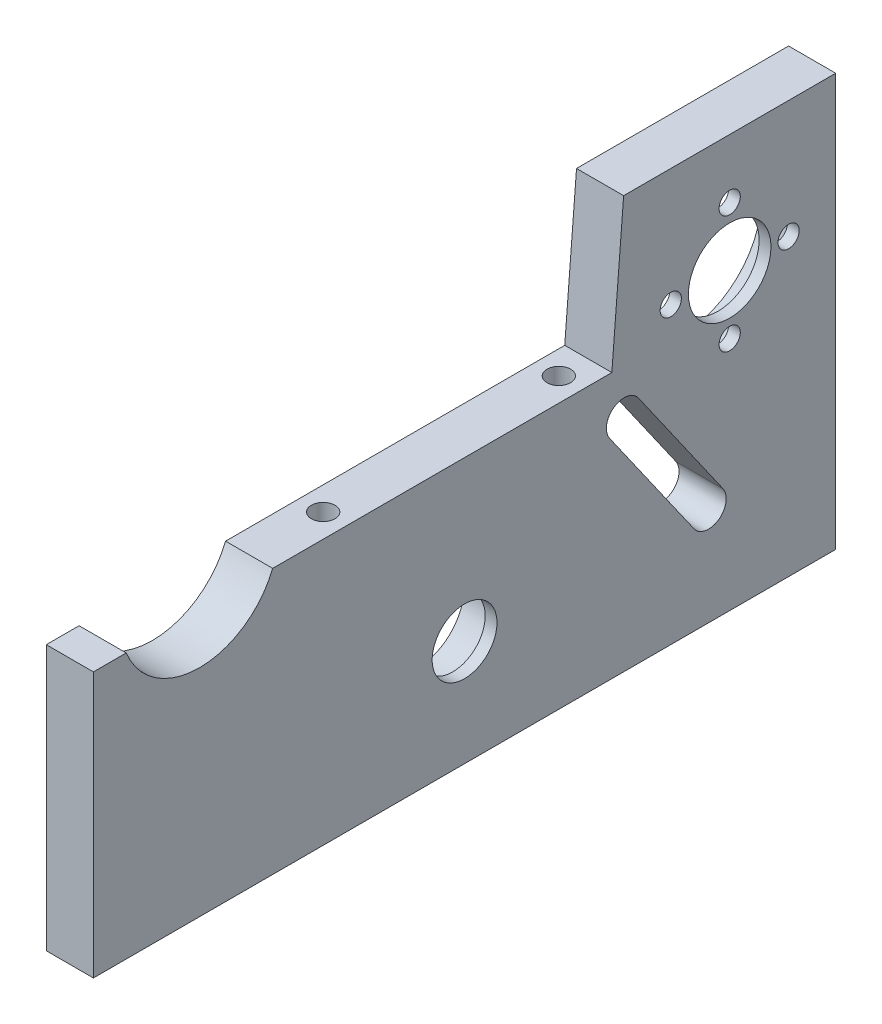
ISO-10303-21;
HEADER;
FILE_DESCRIPTION(('STEP AP214'),'2;1');
FILE_NAME('part.step','',(''),(''),'','','');
FILE_SCHEMA(('AUTOMOTIVE_DESIGN { 1 0 10303 214 1 1 1 1 }'));
ENDSEC;
DATA;
#1=APPLICATION_CONTEXT('core data for automotive mechanical design processes');
#2=APPLICATION_PROTOCOL_DEFINITION('international standard','automotive_design',2000,#1);
#3=PRODUCT_CONTEXT('',#1,'mechanical');
#4=PRODUCT('Part','Part','',(#3));
#5=PRODUCT_RELATED_PRODUCT_CATEGORY('part','',(#4));
#6=PRODUCT_DEFINITION_FORMATION('','',#4);
#7=PRODUCT_DEFINITION_CONTEXT('part definition',#1,'design');
#8=PRODUCT_DEFINITION('design','',#6,#7);
#9=PRODUCT_DEFINITION_SHAPE('','',#8);
#10=(LENGTH_UNIT() NAMED_UNIT(*) SI_UNIT(.MILLI.,.METRE.));
#11=(NAMED_UNIT(*) PLANE_ANGLE_UNIT() SI_UNIT($,.RADIAN.));
#12=(NAMED_UNIT(*) SI_UNIT($,.STERADIAN.) SOLID_ANGLE_UNIT());
#13=UNCERTAINTY_MEASURE_WITH_UNIT(LENGTH_MEASURE(1.E-05),#10,'distance_accuracy_value','');
#14=(GEOMETRIC_REPRESENTATION_CONTEXT(3) GLOBAL_UNCERTAINTY_ASSIGNED_CONTEXT((#13)) GLOBAL_UNIT_ASSIGNED_CONTEXT((#10,
#11,#12)) REPRESENTATION_CONTEXT('',''));
#15=CARTESIAN_POINT('',(0.,0.,0.));
#16=DIRECTION('',(0.,0.,1.));
#17=DIRECTION('',(1.,0.,0.));
#18=AXIS2_PLACEMENT_3D('',#15,#16,#17);
#19=CARTESIAN_POINT('',(10.,18.,-32.));
#20=DIRECTION('',(-1.,0.,0.));
#21=DIRECTION('',(0.,0.,1.));
#22=AXIS2_PLACEMENT_3D('',#19,#20,#21);
#23=CYLINDRICAL_SURFACE('',#22,7.95);
#24=CARTESIAN_POINT('',(0.,18.,-32.));
#25=DIRECTION('',(-1.,0.,0.));
#26=DIRECTION('',(0.,0.,1.));
#27=AXIS2_PLACEMENT_3D('',#24,#25,#26);
#28=CIRCLE('',#27,7.95);
#29=CARTESIAN_POINT('',(0.,18.,-24.05));
#30=VERTEX_POINT('',#29);
#31=EDGE_CURVE('E237',#30,#30,#28,.T.);
#32=ORIENTED_EDGE('',*,*,#31,.T.);
#33=EDGE_LOOP('',(#32));
#34=FACE_BOUND('',#33,.T.);
#35=CARTESIAN_POINT('',(6.,18.,-32.));
#36=DIRECTION('',(1.,0.,0.));
#37=DIRECTION('',(0.,0.,-1.));
#38=AXIS2_PLACEMENT_3D('',#35,#36,#37);
#39=CIRCLE('',#38,7.95);
#40=CARTESIAN_POINT('',(6.,18.,-39.95));
#41=VERTEX_POINT('',#40);
#42=EDGE_CURVE('E12',#41,#41,#39,.F.);
#43=ORIENTED_EDGE('',*,*,#42,.F.);
#44=EDGE_LOOP('',(#43));
#45=FACE_BOUND('',#44,.T.);
#46=ADVANCED_FACE('F55',(#34,#45),#23,.F.);
#47=CARTESIAN_POINT('',(0.,70.,0.));
#48=DIRECTION('',(1.,0.,0.));
#49=DIRECTION('',(0.,0.,-1.));
#50=AXIS2_PLACEMENT_3D('',#47,#48,#49);
#51=PLANE('',#50);
#52=ORIENTED_EDGE('',*,*,#31,.F.);
#53=EDGE_LOOP('',(#52));
#54=FACE_BOUND('',#53,.T.);
#55=CARTESIAN_POINT('',(0.,50.,-77.));
#56=DIRECTION('',(-1.,0.,0.));
#57=DIRECTION('',(0.,0.,1.));
#58=AXIS2_PLACEMENT_3D('',#55,#56,#57);
#59=CIRCLE('',#58,13.4);
#60=CARTESIAN_POINT('',(0.,50.,-63.6));
#61=VERTEX_POINT('',#60);
#62=EDGE_CURVE('E233',#61,#61,#59,.T.);
#63=ORIENTED_EDGE('',*,*,#62,.F.);
#64=EDGE_LOOP('',(#63));
#65=FACE_BOUND('',#64,.T.);
#66=DIRECTION('',(0.,0.81915204428706,0.573576436353805));
#67=VECTOR('',#66,1.);
#68=CARTESIAN_POINT('',(0.,38.2885856990247,-54.6817673466447));
#69=LINE('',#68,#67);
#70=CARTESIAN_POINT('',(0.,15.0509462838338,-70.9529376354771));
#71=VERTEX_POINT('',#70);
#72=CARTESIAN_POINT('',(0.,35.5297473910185,-56.6135267266262));
#73=VERTEX_POINT('',#72);
#74=EDGE_CURVE('E182',#71,#73,#69,.T.);
#75=ORIENTED_EDGE('',*,*,#74,.F.);
#76=CARTESIAN_POINT('',(0.,16.7716755928952,-73.4103937683383));
#77=DIRECTION('',(-1.,0.,0.));
#78=DIRECTION('',(0.,0.,1.));
#79=AXIS2_PLACEMENT_3D('',#76,#77,#78);
#80=CIRCLE('',#79,3.00000000000001);
#81=CARTESIAN_POINT('',(0.,18.4924049019565,-75.8678499011995));
#82=VERTEX_POINT('',#81);
#83=EDGE_CURVE('E178',#82,#71,#80,.T.);
#84=ORIENTED_EDGE('',*,*,#83,.F.);
#85=DIRECTION('',(0.,0.81915204428706,0.573576436353806));
#86=VECTOR('',#85,1.);
#87=CARTESIAN_POINT('',(0.,41.7300443171475,-59.5966796123671));
#88=LINE('',#87,#86);
#89=CARTESIAN_POINT('',(0.,38.9712060091413,-61.5284389923486));
#90=VERTEX_POINT('',#89);
#91=EDGE_CURVE('E175',#82,#90,#88,.T.);
#92=ORIENTED_EDGE('',*,*,#91,.T.);
#93=CARTESIAN_POINT('',(0.,37.2504767000799,-59.0709828594874));
#94=DIRECTION('',(-1.,0.,0.));
#95=DIRECTION('',(0.,0.,1.));
#96=AXIS2_PLACEMENT_3D('',#93,#94,#95);
#97=CIRCLE('',#96,3.);
#98=EDGE_CURVE('E179',#73,#90,#97,.T.);
#99=ORIENTED_EDGE('',*,*,#98,.F.);
#100=EDGE_LOOP('',(#75,#84,#92,#99));
#101=FACE_BOUND('',#100,.T.);
#102=DIRECTION('',(0.,0.996815278536125,-0.07974522228289));
#103=VECTOR('',#102,1.);
#104=CARTESIAN_POINT('',(0.,-4.24483306836248,-53.060413354531));
#105=LINE('',#104,#103);
#106=CARTESIAN_POINT('',(0.,45.,-57.));
#107=VERTEX_POINT('',#106);
#108=CARTESIAN_POINT('',(0.,70.,-59.));
#109=VERTEX_POINT('',#108);
#110=EDGE_CURVE('E153',#107,#109,#105,.T.);
#111=ORIENTED_EDGE('',*,*,#110,.T.);
#112=DIRECTION('',(0.,0.,1.));
#113=VECTOR('',#112,1.);
#114=CARTESIAN_POINT('',(0.,70.,0.));
#115=LINE('',#114,#113);
#116=CARTESIAN_POINT('',(0.,70.,-95.));
#117=VERTEX_POINT('',#116);
#118=EDGE_CURVE('E246',#117,#109,#115,.T.);
#119=ORIENTED_EDGE('',*,*,#118,.F.);
#120=DIRECTION('',(0.,-1.,0.));
#121=VECTOR('',#120,1.);
#122=CARTESIAN_POINT('',(0.,70.,-95.));
#123=LINE('',#122,#121);
#124=CARTESIAN_POINT('',(0.,0.,-95.));
#125=VERTEX_POINT('',#124);
#126=EDGE_CURVE('E267',#117,#125,#123,.T.);
#127=ORIENTED_EDGE('',*,*,#126,.T.);
#128=DIRECTION('',(0.,0.,1.));
#129=VECTOR('',#128,1.);
#130=CARTESIAN_POINT('',(0.,0.,0.));
#131=LINE('',#130,#129);
#132=CARTESIAN_POINT('',(0.,0.,31.));
#133=VERTEX_POINT('',#132);
#134=EDGE_CURVE('E254',#125,#133,#131,.T.);
#135=ORIENTED_EDGE('',*,*,#134,.T.);
#136=DIRECTION('',(0.,-1.,0.));
#137=VECTOR('',#136,1.);
#138=CARTESIAN_POINT('',(0.,70.,31.));
#139=LINE('',#138,#137);
#140=CARTESIAN_POINT('',(0.,45.,31.));
#141=VERTEX_POINT('',#140);
#142=EDGE_CURVE('E265',#141,#133,#139,.T.);
#143=ORIENTED_EDGE('',*,*,#142,.F.);
#144=DIRECTION('',(0.,0.,-1.));
#145=VECTOR('',#144,1.);
#146=CARTESIAN_POINT('',(0.,45.,0.));
#147=LINE('',#146,#145);
#148=CARTESIAN_POINT('',(0.,45.,25.432216214336));
#149=VERTEX_POINT('',#148);
#150=EDGE_CURVE('E150',#141,#149,#147,.T.);
#151=ORIENTED_EDGE('',*,*,#150,.T.);
#152=CARTESIAN_POINT('',(0.,50.,13.));
#153=DIRECTION('',(-1.,0.,0.));
#154=DIRECTION('',(0.,0.,1.));
#155=AXIS2_PLACEMENT_3D('',#152,#153,#154);
#156=CIRCLE('',#155,13.4);
#157=CARTESIAN_POINT('',(0.,45.,0.56778378566396));
#158=VERTEX_POINT('',#157);
#159=EDGE_CURVE('E164',#158,#149,#156,.T.);
#160=ORIENTED_EDGE('',*,*,#159,.F.);
#161=EDGE_CURVE('E78',#158,#107,#147,.T.);
#162=ORIENTED_EDGE('',*,*,#161,.T.);
#163=EDGE_LOOP('',(#111,#119,#127,#135,#143,#151,#160,#162));
#164=FACE_BOUND('',#163,.T.);
#165=ADVANCED_FACE('F161',(#54,#65,#101,#164),#51,.F.);
#166=CARTESIAN_POINT('',(0.,70.,31.));
#167=DIRECTION('',(0.,0.,-1.));
#168=DIRECTION('',(-1.,0.,0.));
#169=AXIS2_PLACEMENT_3D('',#166,#167,#168);
#170=PLANE('',#169);
#171=DIRECTION('',(-1.,0.,0.));
#172=VECTOR('',#171,1.);
#173=CARTESIAN_POINT('',(10.,45.,31.));
#174=LINE('',#173,#172);
#175=CARTESIAN_POINT('',(8.,45.,31.));
#176=VERTEX_POINT('',#175);
#177=EDGE_CURVE('E149',#176,#141,#174,.T.);
#178=ORIENTED_EDGE('',*,*,#177,.T.);
#179=ORIENTED_EDGE('',*,*,#142,.T.);
#180=DIRECTION('',(1.,0.,0.));
#181=VECTOR('',#180,1.);
#182=CARTESIAN_POINT('',(0.,0.,31.));
#183=LINE('',#182,#181);
#184=CARTESIAN_POINT('',(8.,0.,31.));
#185=VERTEX_POINT('',#184);
#186=EDGE_CURVE('E257',#133,#185,#183,.T.);
#187=ORIENTED_EDGE('',*,*,#186,.T.);
#188=DIRECTION('',(0.,-1.,0.));
#189=VECTOR('',#188,1.);
#190=CARTESIAN_POINT('',(8.,70.,31.));
#191=LINE('',#190,#189);
#192=EDGE_CURVE('E263',#176,#185,#191,.T.);
#193=ORIENTED_EDGE('',*,*,#192,.F.);
#194=EDGE_LOOP('',(#178,#179,#187,#193));
#195=FACE_BOUND('',#194,.T.);
#196=ADVANCED_FACE('F315',(#195),#170,.F.);
#197=CARTESIAN_POINT('',(8.,70.,0.));
#198=DIRECTION('',(-1.,0.,0.));
#199=DIRECTION('',(0.,0.,1.));
#200=AXIS2_PLACEMENT_3D('',#197,#198,#199);
#201=PLANE('',#200);
#202=CARTESIAN_POINT('',(8.,50.,-77.));
#203=DIRECTION('',(-1.,0.,0.));
#204=DIRECTION('',(0.,0.,1.));
#205=AXIS2_PLACEMENT_3D('',#202,#203,#204);
#206=CIRCLE('',#205,7.);
#207=CARTESIAN_POINT('',(8.,50.,-70.));
#208=VERTEX_POINT('',#207);
#209=EDGE_CURVE('E214',#208,#208,#206,.T.);
#210=ORIENTED_EDGE('',*,*,#209,.T.);
#211=EDGE_LOOP('',(#210));
#212=FACE_BOUND('',#211,.T.);
#213=CARTESIAN_POINT('',(8.,50.,-87.));
#214=DIRECTION('',(-1.,0.,0.));
#215=DIRECTION('',(0.,0.,1.));
#216=AXIS2_PLACEMENT_3D('',#213,#214,#215);
#217=CIRCLE('',#216,1.79999999999999);
#218=CARTESIAN_POINT('',(8.,50.,-85.2));
#219=VERTEX_POINT('',#218);
#220=EDGE_CURVE('E218',#219,#219,#217,.T.);
#221=ORIENTED_EDGE('',*,*,#220,.T.);
#222=EDGE_LOOP('',(#221));
#223=FACE_BOUND('',#222,.T.);
#224=CARTESIAN_POINT('',(8.,40.,-77.));
#225=DIRECTION('',(-1.,0.,0.));
#226=DIRECTION('',(0.,0.,1.));
#227=AXIS2_PLACEMENT_3D('',#224,#225,#226);
#228=CIRCLE('',#227,1.79999999999999);
#229=CARTESIAN_POINT('',(8.,40.,-75.2));
#230=VERTEX_POINT('',#229);
#231=EDGE_CURVE('E222',#230,#230,#228,.T.);
#232=ORIENTED_EDGE('',*,*,#231,.T.);
#233=EDGE_LOOP('',(#232));
#234=FACE_BOUND('',#233,.T.);
#235=CARTESIAN_POINT('',(8.,50.,-67.));
#236=DIRECTION('',(-1.,0.,0.));
#237=DIRECTION('',(0.,0.,1.));
#238=AXIS2_PLACEMENT_3D('',#235,#236,#237);
#239=CIRCLE('',#238,1.79999999999999);
#240=CARTESIAN_POINT('',(8.,50.,-65.2));
#241=VERTEX_POINT('',#240);
#242=EDGE_CURVE('E226',#241,#241,#239,.T.);
#243=ORIENTED_EDGE('',*,*,#242,.T.);
#244=EDGE_LOOP('',(#243));
#245=FACE_BOUND('',#244,.T.);
#246=CARTESIAN_POINT('',(8.,60.,-77.));
#247=DIRECTION('',(-1.,0.,0.));
#248=DIRECTION('',(0.,0.,1.));
#249=AXIS2_PLACEMENT_3D('',#246,#247,#248);
#250=CIRCLE('',#249,1.79999999999999);
#251=CARTESIAN_POINT('',(8.,60.,-75.2));
#252=VERTEX_POINT('',#251);
#253=EDGE_CURVE('E230',#252,#252,#250,.T.);
#254=ORIENTED_EDGE('',*,*,#253,.T.);
#255=EDGE_LOOP('',(#254));
#256=FACE_BOUND('',#255,.T.);
#257=DIRECTION('',(0.,0.81915204428706,0.573576436353806));
#258=VECTOR('',#257,1.);
#259=CARTESIAN_POINT('',(8.,88.7007493333244,-26.7074378847796));
#260=LINE('',#259,#258);
#261=CARTESIAN_POINT('',(8.,18.4924049019565,-75.8678499011995));
#262=VERTEX_POINT('',#261);
#263=CARTESIAN_POINT('',(8.,38.9712060091413,-61.5284389923486));
#264=VERTEX_POINT('',#263);
#265=EDGE_CURVE('E286',#262,#264,#260,.T.);
#266=ORIENTED_EDGE('',*,*,#265,.F.);
#267=CARTESIAN_POINT('',(8.,16.7716755928952,-73.4103937683383));
#268=DIRECTION('',(-1.,0.,0.));
#269=DIRECTION('',(0.,0.,1.));
#270=AXIS2_PLACEMENT_3D('',#267,#268,#269);
#271=CIRCLE('',#270,3.00000000000001);
#272=CARTESIAN_POINT('',(8.,15.0509462838338,-70.9529376354771));
#273=VERTEX_POINT('',#272);
#274=EDGE_CURVE('E289',#262,#273,#271,.T.);
#275=ORIENTED_EDGE('',*,*,#274,.T.);
#276=DIRECTION('',(0.,0.81915204428706,0.573576436353805));
#277=VECTOR('',#276,1.);
#278=CARTESIAN_POINT('',(8.,85.2592907152015,-21.7925256190573));
#279=LINE('',#278,#277);
#280=CARTESIAN_POINT('',(8.,35.5297473910185,-56.6135267266262));
#281=VERTEX_POINT('',#280);
#282=EDGE_CURVE('E283',#273,#281,#279,.T.);
#283=ORIENTED_EDGE('',*,*,#282,.T.);
#284=CARTESIAN_POINT('',(8.,37.2504767000799,-59.0709828594874));
#285=DIRECTION('',(-1.,0.,0.));
#286=DIRECTION('',(0.,0.,1.));
#287=AXIS2_PLACEMENT_3D('',#284,#285,#286);
#288=CIRCLE('',#287,3.);
#289=EDGE_CURVE('E270',#281,#264,#288,.T.);
#290=ORIENTED_EDGE('',*,*,#289,.T.);
#291=EDGE_LOOP('',(#266,#275,#283,#290));
#292=FACE_BOUND('',#291,.T.);
#293=DIRECTION('',(0.,0.,-1.));
#294=VECTOR('',#293,1.);
#295=CARTESIAN_POINT('',(8.,45.,0.));
#296=LINE('',#295,#294);
#297=CARTESIAN_POINT('',(8.,45.,25.432216214336));
#298=VERTEX_POINT('',#297);
#299=EDGE_CURVE('E70',#176,#298,#296,.T.);
#300=ORIENTED_EDGE('',*,*,#299,.F.);
#301=ORIENTED_EDGE('',*,*,#192,.T.);
#302=DIRECTION('',(0.,0.,-1.));
#303=VECTOR('',#302,1.);
#304=CARTESIAN_POINT('',(8.,0.,0.));
#305=LINE('',#304,#303);
#306=CARTESIAN_POINT('',(8.,0.,-95.));
#307=VERTEX_POINT('',#306);
#308=EDGE_CURVE('E247',#185,#307,#305,.T.);
#309=ORIENTED_EDGE('',*,*,#308,.T.);
#310=DIRECTION('',(0.,-1.,0.));
#311=VECTOR('',#310,1.);
#312=CARTESIAN_POINT('',(8.,70.,-95.));
#313=LINE('',#312,#311);
#314=CARTESIAN_POINT('',(8.,70.,-95.));
#315=VERTEX_POINT('',#314);
#316=EDGE_CURVE('E251',#315,#307,#313,.T.);
#317=ORIENTED_EDGE('',*,*,#316,.F.);
#318=DIRECTION('',(0.,0.,-1.));
#319=VECTOR('',#318,1.);
#320=CARTESIAN_POINT('',(8.,70.,0.));
#321=LINE('',#320,#319);
#322=CARTESIAN_POINT('',(8.,70.,-59.));
#323=VERTEX_POINT('',#322);
#324=EDGE_CURVE('E249',#323,#315,#321,.T.);
#325=ORIENTED_EDGE('',*,*,#324,.F.);
#326=DIRECTION('',(0.,0.996815278536125,-0.07974522228289));
#327=VECTOR('',#326,1.);
#328=CARTESIAN_POINT('',(8.,65.3100158982512,-58.6248012718601));
#329=LINE('',#328,#327);
#330=CARTESIAN_POINT('',(8.,45.,-57.));
#331=VERTEX_POINT('',#330);
#332=EDGE_CURVE('E171',#331,#323,#329,.T.);
#333=ORIENTED_EDGE('',*,*,#332,.F.);
#334=CARTESIAN_POINT('',(8.,45.,0.56778378566396));
#335=VERTEX_POINT('',#334);
#336=EDGE_CURVE('E146',#335,#331,#296,.T.);
#337=ORIENTED_EDGE('',*,*,#336,.F.);
#338=CARTESIAN_POINT('',(8.,50.,13.));
#339=DIRECTION('',(-1.,0.,0.));
#340=DIRECTION('',(0.,0.,1.));
#341=AXIS2_PLACEMENT_3D('',#338,#339,#340);
#342=CIRCLE('',#341,13.4);
#343=EDGE_CURVE('E174',#335,#298,#342,.T.);
#344=ORIENTED_EDGE('',*,*,#343,.T.);
#345=EDGE_LOOP('',(#300,#301,#309,#317,#325,#333,#337,#344));
#346=FACE_BOUND('',#345,.T.);
#347=CARTESIAN_POINT('',(8.,18.,-32.));
#348=DIRECTION('',(1.,0.,0.));
#349=DIRECTION('',(0.,0.,-1.));
#350=AXIS2_PLACEMENT_3D('',#347,#348,#349);
#351=CIRCLE('',#350,5.5);
#352=CARTESIAN_POINT('',(8.,18.,-37.5));
#353=VERTEX_POINT('',#352);
#354=EDGE_CURVE('E482',#353,#353,#351,.T.);
#355=ORIENTED_EDGE('',*,*,#354,.F.);
#356=EDGE_LOOP('',(#355));
#357=FACE_BOUND('',#356,.T.);
#358=ADVANCED_FACE('F302',(#212,#223,#234,#245,#256,#292,#346,#357),#201,.F.);
#359=CARTESIAN_POINT('',(0.,70.,0.));
#360=DIRECTION('',(0.,1.,0.));
#361=DIRECTION('',(0.,0.,1.));
#362=AXIS2_PLACEMENT_3D('',#359,#360,#361);
#363=PLANE('',#362);
#364=ORIENTED_EDGE('',*,*,#118,.T.);
#365=DIRECTION('',(1.,0.,0.));
#366=VECTOR('',#365,1.);
#367=CARTESIAN_POINT('',(0.,70.,-59.));
#368=LINE('',#367,#366);
#369=EDGE_CURVE('E63',#109,#323,#368,.T.);
#370=ORIENTED_EDGE('',*,*,#369,.T.);
#371=ORIENTED_EDGE('',*,*,#324,.T.);
#372=DIRECTION('',(-1.,0.,0.));
#373=VECTOR('',#372,1.);
#374=CARTESIAN_POINT('',(0.,70.,-95.));
#375=LINE('',#374,#373);
#376=EDGE_CURVE('E243',#315,#117,#375,.T.);
#377=ORIENTED_EDGE('',*,*,#376,.T.);
#378=EDGE_LOOP('',(#364,#370,#371,#377));
#379=FACE_BOUND('',#378,.T.);
#380=ADVANCED_FACE('F299',(#379),#363,.T.);
#381=CARTESIAN_POINT('',(10.,50.,13.));
#382=DIRECTION('',(-1.,0.,0.));
#383=DIRECTION('',(0.,0.,1.));
#384=AXIS2_PLACEMENT_3D('',#381,#382,#383);
#385=CYLINDRICAL_SURFACE('',#384,13.4);
#386=DIRECTION('',(-1.,0.,0.));
#387=VECTOR('',#386,1.);
#388=CARTESIAN_POINT('',(10.,45.,0.56778378566396));
#389=LINE('',#388,#387);
#390=EDGE_CURVE('E296',#158,#335,#389,.F.);
#391=ORIENTED_EDGE('',*,*,#390,.F.);
#392=ORIENTED_EDGE('',*,*,#159,.T.);
#393=DIRECTION('',(-1.,0.,0.));
#394=VECTOR('',#393,1.);
#395=CARTESIAN_POINT('',(10.,45.,25.432216214336));
#396=LINE('',#395,#394);
#397=EDGE_CURVE('E292',#298,#149,#396,.T.);
#398=ORIENTED_EDGE('',*,*,#397,.F.);
#399=ORIENTED_EDGE('',*,*,#343,.F.);
#400=EDGE_LOOP('',(#391,#392,#398,#399));
#401=FACE_BOUND('',#400,.T.);
#402=ADVANCED_FACE('F319',(#401),#385,.F.);
#403=CARTESIAN_POINT('',(0.,70.,-95.));
#404=DIRECTION('',(0.,0.,1.));
#405=DIRECTION('',(1.,0.,0.));
#406=AXIS2_PLACEMENT_3D('',#403,#404,#405);
#407=PLANE('',#406);
#408=DIRECTION('',(-1.,0.,0.));
#409=VECTOR('',#408,1.);
#410=CARTESIAN_POINT('',(0.,0.,-95.));
#411=LINE('',#410,#409);
#412=EDGE_CURVE('E242',#307,#125,#411,.T.);
#413=ORIENTED_EDGE('',*,*,#412,.T.);
#414=ORIENTED_EDGE('',*,*,#126,.F.);
#415=ORIENTED_EDGE('',*,*,#376,.F.);
#416=ORIENTED_EDGE('',*,*,#316,.T.);
#417=EDGE_LOOP('',(#413,#414,#415,#416));
#418=FACE_BOUND('',#417,.T.);
#419=ADVANCED_FACE('F57',(#418),#407,.F.);
#420=CARTESIAN_POINT('',(0.,0.,0.));
#421=DIRECTION('',(0.,1.,0.));
#422=DIRECTION('',(0.,0.,1.));
#423=AXIS2_PLACEMENT_3D('',#420,#421,#422);
#424=PLANE('',#423);
#425=CARTESIAN_POINT('',(4.,0.,-91.));
#426=DIRECTION('',(0.,-1.,0.));
#427=DIRECTION('',(0.,0.,-1.));
#428=AXIS2_PLACEMENT_3D('',#425,#426,#427);
#429=CIRCLE('',#428,2.);
#430=CARTESIAN_POINT('',(4.,0.,-93.));
#431=VERTEX_POINT('',#430);
#432=EDGE_CURVE('E200',#431,#431,#429,.T.);
#433=ORIENTED_EDGE('',*,*,#432,.F.);
#434=EDGE_LOOP('',(#433));
#435=FACE_BOUND('',#434,.T.);
#436=CARTESIAN_POINT('',(4.,0.,-4.));
#437=DIRECTION('',(0.,-1.,0.));
#438=DIRECTION('',(0.,0.,-1.));
#439=AXIS2_PLACEMENT_3D('',#436,#437,#438);
#440=CIRCLE('',#439,2.);
#441=CARTESIAN_POINT('',(4.,0.,-6.));
#442=VERTEX_POINT('',#441);
#443=EDGE_CURVE('E206',#442,#442,#440,.T.);
#444=ORIENTED_EDGE('',*,*,#443,.F.);
#445=EDGE_LOOP('',(#444));
#446=FACE_BOUND('',#445,.T.);
#447=CARTESIAN_POINT('',(4.,0.,27.));
#448=DIRECTION('',(0.,-1.,0.));
#449=DIRECTION('',(0.,0.,-1.));
#450=AXIS2_PLACEMENT_3D('',#447,#448,#449);
#451=CIRCLE('',#450,2.);
#452=CARTESIAN_POINT('',(4.,0.,25.));
#453=VERTEX_POINT('',#452);
#454=EDGE_CURVE('E187',#453,#453,#451,.T.);
#455=ORIENTED_EDGE('',*,*,#454,.F.);
#456=EDGE_LOOP('',(#455));
#457=FACE_BOUND('',#456,.T.);
#458=ORIENTED_EDGE('',*,*,#412,.F.);
#459=ORIENTED_EDGE('',*,*,#308,.F.);
#460=ORIENTED_EDGE('',*,*,#186,.F.);
#461=ORIENTED_EDGE('',*,*,#134,.F.);
#462=EDGE_LOOP('',(#458,#459,#460,#461));
#463=FACE_BOUND('',#462,.T.);
#464=ADVANCED_FACE('F312',(#435,#446,#457,#463),#424,.F.);
#465=CARTESIAN_POINT('',(6.,50.,-77.));
#466=DIRECTION('',(-1.,0.,0.));
#467=DIRECTION('',(0.,0.,1.));
#468=AXIS2_PLACEMENT_3D('',#465,#466,#467);
#469=CYLINDRICAL_SURFACE('',#468,13.4);
#470=CARTESIAN_POINT('',(6.,50.,-77.));
#471=DIRECTION('',(-1.,0.,0.));
#472=DIRECTION('',(0.,0.,1.));
#473=AXIS2_PLACEMENT_3D('',#470,#471,#472);
#474=CIRCLE('',#473,13.4);
#475=CARTESIAN_POINT('',(6.,50.,-63.6));
#476=VERTEX_POINT('',#475);
#477=EDGE_CURVE('E234',#476,#476,#474,.T.);
#478=ORIENTED_EDGE('',*,*,#477,.F.);
#479=EDGE_LOOP('',(#478));
#480=FACE_BOUND('',#479,.T.);
#481=ORIENTED_EDGE('',*,*,#62,.T.);
#482=EDGE_LOOP('',(#481));
#483=FACE_BOUND('',#482,.T.);
#484=ADVANCED_FACE('F338',(#480,#483),#469,.F.);
#485=CARTESIAN_POINT('',(6.,50.,-77.));
#486=DIRECTION('',(-1.,0.,0.));
#487=DIRECTION('',(0.,0.,1.));
#488=AXIS2_PLACEMENT_3D('',#485,#486,#487);
#489=PLANE('',#488);
#490=CARTESIAN_POINT('',(6.,60.,-77.));
#491=DIRECTION('',(-1.,0.,0.));
#492=DIRECTION('',(0.,0.,1.));
#493=AXIS2_PLACEMENT_3D('',#490,#491,#492);
#494=CIRCLE('',#493,1.79999999999999);
#495=CARTESIAN_POINT('',(6.,60.,-75.2));
#496=VERTEX_POINT('',#495);
#497=EDGE_CURVE('E229',#496,#496,#494,.T.);
#498=ORIENTED_EDGE('',*,*,#497,.F.);
#499=EDGE_LOOP('',(#498));
#500=FACE_BOUND('',#499,.T.);
#501=CARTESIAN_POINT('',(6.,50.,-67.));
#502=DIRECTION('',(-1.,0.,0.));
#503=DIRECTION('',(0.,0.,1.));
#504=AXIS2_PLACEMENT_3D('',#501,#502,#503);
#505=CIRCLE('',#504,1.79999999999999);
#506=CARTESIAN_POINT('',(6.,50.,-65.2));
#507=VERTEX_POINT('',#506);
#508=EDGE_CURVE('E225',#507,#507,#505,.T.);
#509=ORIENTED_EDGE('',*,*,#508,.F.);
#510=EDGE_LOOP('',(#509));
#511=FACE_BOUND('',#510,.T.);
#512=CARTESIAN_POINT('',(6.,40.,-77.));
#513=DIRECTION('',(-1.,0.,0.));
#514=DIRECTION('',(0.,0.,1.));
#515=AXIS2_PLACEMENT_3D('',#512,#513,#514);
#516=CIRCLE('',#515,1.79999999999999);
#517=CARTESIAN_POINT('',(6.,40.,-75.2));
#518=VERTEX_POINT('',#517);
#519=EDGE_CURVE('E221',#518,#518,#516,.T.);
#520=ORIENTED_EDGE('',*,*,#519,.F.);
#521=EDGE_LOOP('',(#520));
#522=FACE_BOUND('',#521,.T.);
#523=CARTESIAN_POINT('',(6.,50.,-87.));
#524=DIRECTION('',(-1.,0.,0.));
#525=DIRECTION('',(0.,0.,1.));
#526=AXIS2_PLACEMENT_3D('',#523,#524,#525);
#527=CIRCLE('',#526,1.79999999999999);
#528=CARTESIAN_POINT('',(6.,50.,-85.2));
#529=VERTEX_POINT('',#528);
#530=EDGE_CURVE('E217',#529,#529,#527,.T.);
#531=ORIENTED_EDGE('',*,*,#530,.F.);
#532=EDGE_LOOP('',(#531));
#533=FACE_BOUND('',#532,.T.);
#534=CARTESIAN_POINT('',(6.,50.,-77.));
#535=DIRECTION('',(-1.,0.,0.));
#536=DIRECTION('',(0.,0.,1.));
#537=AXIS2_PLACEMENT_3D('',#534,#535,#536);
#538=CIRCLE('',#537,7.);
#539=CARTESIAN_POINT('',(6.,50.,-70.));
#540=VERTEX_POINT('',#539);
#541=EDGE_CURVE('E199',#540,#540,#538,.T.);
#542=ORIENTED_EDGE('',*,*,#541,.F.);
#543=EDGE_LOOP('',(#542));
#544=FACE_BOUND('',#543,.T.);
#545=ORIENTED_EDGE('',*,*,#477,.T.);
#546=EDGE_LOOP('',(#545));
#547=FACE_BOUND('',#546,.T.);
#548=ADVANCED_FACE('F656',(#500,#511,#522,#533,#544,#547),#489,.T.);
#549=CARTESIAN_POINT('',(10.,50.,-77.));
#550=DIRECTION('',(-1.,0.,0.));
#551=DIRECTION('',(0.,0.,1.));
#552=AXIS2_PLACEMENT_3D('',#549,#550,#551);
#553=CYLINDRICAL_SURFACE('',#552,7.);
#554=ORIENTED_EDGE('',*,*,#541,.T.);
#555=EDGE_LOOP('',(#554));
#556=FACE_BOUND('',#555,.T.);
#557=ORIENTED_EDGE('',*,*,#209,.F.);
#558=EDGE_LOOP('',(#557));
#559=FACE_BOUND('',#558,.T.);
#560=ADVANCED_FACE('F646',(#556,#559),#553,.F.);
#561=CARTESIAN_POINT('',(10.,50.,-87.));
#562=DIRECTION('',(-1.,0.,0.));
#563=DIRECTION('',(0.,0.,1.));
#564=AXIS2_PLACEMENT_3D('',#561,#562,#563);
#565=CYLINDRICAL_SURFACE('',#564,1.79999999999999);
#566=ORIENTED_EDGE('',*,*,#530,.T.);
#567=EDGE_LOOP('',(#566));
#568=FACE_BOUND('',#567,.T.);
#569=ORIENTED_EDGE('',*,*,#220,.F.);
#570=EDGE_LOOP('',(#569));
#571=FACE_BOUND('',#570,.T.);
#572=ADVANCED_FACE('F636',(#568,#571),#565,.F.);
#573=CARTESIAN_POINT('',(10.,40.,-77.));
#574=DIRECTION('',(-1.,0.,0.));
#575=DIRECTION('',(0.,0.,1.));
#576=AXIS2_PLACEMENT_3D('',#573,#574,#575);
#577=CYLINDRICAL_SURFACE('',#576,1.79999999999999);
#578=ORIENTED_EDGE('',*,*,#519,.T.);
#579=EDGE_LOOP('',(#578));
#580=FACE_BOUND('',#579,.T.);
#581=ORIENTED_EDGE('',*,*,#231,.F.);
#582=EDGE_LOOP('',(#581));
#583=FACE_BOUND('',#582,.T.);
#584=ADVANCED_FACE('F626',(#580,#583),#577,.F.);
#585=CARTESIAN_POINT('',(10.,50.,-67.));
#586=DIRECTION('',(-1.,0.,0.));
#587=DIRECTION('',(0.,0.,1.));
#588=AXIS2_PLACEMENT_3D('',#585,#586,#587);
#589=CYLINDRICAL_SURFACE('',#588,1.79999999999999);
#590=ORIENTED_EDGE('',*,*,#508,.T.);
#591=EDGE_LOOP('',(#590));
#592=FACE_BOUND('',#591,.T.);
#593=ORIENTED_EDGE('',*,*,#242,.F.);
#594=EDGE_LOOP('',(#593));
#595=FACE_BOUND('',#594,.T.);
#596=ADVANCED_FACE('F616',(#592,#595),#589,.F.);
#597=CARTESIAN_POINT('',(10.,60.,-77.));
#598=DIRECTION('',(-1.,0.,0.));
#599=DIRECTION('',(0.,0.,1.));
#600=AXIS2_PLACEMENT_3D('',#597,#598,#599);
#601=CYLINDRICAL_SURFACE('',#600,1.79999999999999);
#602=ORIENTED_EDGE('',*,*,#497,.T.);
#603=EDGE_LOOP('',(#602));
#604=FACE_BOUND('',#603,.T.);
#605=ORIENTED_EDGE('',*,*,#253,.F.);
#606=EDGE_LOOP('',(#605));
#607=FACE_BOUND('',#606,.T.);
#608=ADVANCED_FACE('F597',(#604,#607),#601,.F.);
#609=CARTESIAN_POINT('',(4.,15.,27.));
#610=DIRECTION('',(0.,-1.,0.));
#611=DIRECTION('',(0.,0.,-1.));
#612=AXIS2_PLACEMENT_3D('',#609,#610,#611);
#613=CYLINDRICAL_SURFACE('',#612,2.);
#614=CARTESIAN_POINT('',(4.,15.,27.));
#615=DIRECTION('',(0.,-1.,0.));
#616=DIRECTION('',(0.,0.,-1.));
#617=AXIS2_PLACEMENT_3D('',#614,#615,#616);
#618=CIRCLE('',#617,2.);
#619=CARTESIAN_POINT('',(4.,15.,25.));
#620=VERTEX_POINT('',#619);
#621=EDGE_CURVE('E209',#620,#620,#618,.T.);
#622=ORIENTED_EDGE('',*,*,#621,.F.);
#623=EDGE_LOOP('',(#622));
#624=FACE_BOUND('',#623,.T.);
#625=ORIENTED_EDGE('',*,*,#454,.T.);
#626=EDGE_LOOP('',(#625));
#627=FACE_BOUND('',#626,.T.);
#628=ADVANCED_FACE('F587',(#624,#627),#613,.F.);
#629=CARTESIAN_POINT('',(4.,15.,27.));
#630=DIRECTION('',(0.,-1.,0.));
#631=DIRECTION('',(0.,0.,-1.));
#632=AXIS2_PLACEMENT_3D('',#629,#630,#631);
#633=PLANE('',#632);
#634=ORIENTED_EDGE('',*,*,#621,.T.);
#635=EDGE_LOOP('',(#634));
#636=FACE_BOUND('',#635,.T.);
#637=ADVANCED_FACE('F577',(#636),#633,.T.);
#638=CARTESIAN_POINT('',(4.,15.,-4.));
#639=DIRECTION('',(0.,-1.,0.));
#640=DIRECTION('',(0.,0.,-1.));
#641=AXIS2_PLACEMENT_3D('',#638,#639,#640);
#642=CYLINDRICAL_SURFACE('',#641,2.);
#643=CARTESIAN_POINT('',(4.,15.,-4.));
#644=DIRECTION('',(0.,-1.,0.));
#645=DIRECTION('',(0.,0.,-1.));
#646=AXIS2_PLACEMENT_3D('',#643,#644,#645);
#647=CIRCLE('',#646,2.);
#648=CARTESIAN_POINT('',(4.,15.,-6.));
#649=VERTEX_POINT('',#648);
#650=EDGE_CURVE('E203',#649,#649,#647,.T.);
#651=ORIENTED_EDGE('',*,*,#650,.F.);
#652=EDGE_LOOP('',(#651));
#653=FACE_BOUND('',#652,.T.);
#654=ORIENTED_EDGE('',*,*,#443,.T.);
#655=EDGE_LOOP('',(#654));
#656=FACE_BOUND('',#655,.T.);
#657=ADVANCED_FACE('F567',(#653,#656),#642,.F.);
#658=CARTESIAN_POINT('',(4.,15.,-4.));
#659=DIRECTION('',(0.,-1.,0.));
#660=DIRECTION('',(0.,0.,-1.));
#661=AXIS2_PLACEMENT_3D('',#658,#659,#660);
#662=PLANE('',#661);
#663=ORIENTED_EDGE('',*,*,#650,.T.);
#664=EDGE_LOOP('',(#663));
#665=FACE_BOUND('',#664,.T.);
#666=ADVANCED_FACE('F557',(#665),#662,.T.);
#667=CARTESIAN_POINT('',(4.,15.,-91.));
#668=DIRECTION('',(0.,-1.,0.));
#669=DIRECTION('',(0.,0.,-1.));
#670=AXIS2_PLACEMENT_3D('',#667,#668,#669);
#671=CYLINDRICAL_SURFACE('',#670,2.);
#672=CARTESIAN_POINT('',(4.,15.,-91.));
#673=DIRECTION('',(0.,-1.,0.));
#674=DIRECTION('',(0.,0.,-1.));
#675=AXIS2_PLACEMENT_3D('',#672,#673,#674);
#676=CIRCLE('',#675,2.);
#677=CARTESIAN_POINT('',(4.,15.,-93.));
#678=VERTEX_POINT('',#677);
#679=EDGE_CURVE('E196',#678,#678,#676,.T.);
#680=ORIENTED_EDGE('',*,*,#679,.F.);
#681=EDGE_LOOP('',(#680));
#682=FACE_BOUND('',#681,.T.);
#683=ORIENTED_EDGE('',*,*,#432,.T.);
#684=EDGE_LOOP('',(#683));
#685=FACE_BOUND('',#684,.T.);
#686=ADVANCED_FACE('F547',(#682,#685),#671,.F.);
#687=CARTESIAN_POINT('',(4.,15.,-91.));
#688=DIRECTION('',(0.,-1.,0.));
#689=DIRECTION('',(0.,0.,-1.));
#690=AXIS2_PLACEMENT_3D('',#687,#688,#689);
#691=PLANE('',#690);
#692=ORIENTED_EDGE('',*,*,#679,.T.);
#693=EDGE_LOOP('',(#692));
#694=FACE_BOUND('',#693,.T.);
#695=ADVANCED_FACE('F537',(#694),#691,.T.);
#696=CARTESIAN_POINT('',(10.,41.7300443171475,-59.5966796123671));
#697=DIRECTION('',(0.,-0.573576436353806,0.81915204428706));
#698=DIRECTION('',(0.,-0.81915204428706,-0.573576436353806));
#699=AXIS2_PLACEMENT_3D('',#696,#697,#698);
#700=PLANE('',#699);
#701=ORIENTED_EDGE('',*,*,#265,.T.);
#702=DIRECTION('',(-1.,0.,0.));
#703=VECTOR('',#702,1.);
#704=CARTESIAN_POINT('',(10.,38.9712060091413,-61.5284389923486));
#705=LINE('',#704,#703);
#706=EDGE_CURVE('E185',#264,#90,#705,.T.);
#707=ORIENTED_EDGE('',*,*,#706,.T.);
#708=ORIENTED_EDGE('',*,*,#91,.F.);
#709=DIRECTION('',(-1.,0.,0.));
#710=VECTOR('',#709,1.);
#711=CARTESIAN_POINT('',(10.,18.4924049019565,-75.8678499011995));
#712=LINE('',#711,#710);
#713=EDGE_CURVE('E184',#262,#82,#712,.T.);
#714=ORIENTED_EDGE('',*,*,#713,.F.);
#715=EDGE_LOOP('',(#701,#707,#708,#714));
#716=FACE_BOUND('',#715,.T.);
#717=ADVANCED_FACE('F528',(#716),#700,.T.);
#718=CARTESIAN_POINT('',(10.,38.2885856990247,-54.6817673466447));
#719=DIRECTION('',(0.,-0.573576436353805,0.81915204428706));
#720=DIRECTION('',(0.,-0.81915204428706,-0.573576436353805));
#721=AXIS2_PLACEMENT_3D('',#718,#719,#720);
#722=PLANE('',#721);
#723=DIRECTION('',(-1.,0.,0.));
#724=VECTOR('',#723,1.);
#725=CARTESIAN_POINT('',(10.,15.0509462838338,-70.9529376354771));
#726=LINE('',#725,#724);
#727=EDGE_CURVE('E191',#273,#71,#726,.T.);
#728=ORIENTED_EDGE('',*,*,#727,.T.);
#729=ORIENTED_EDGE('',*,*,#74,.T.);
#730=DIRECTION('',(-1.,0.,0.));
#731=VECTOR('',#730,1.);
#732=CARTESIAN_POINT('',(10.,35.5297473910185,-56.6135267266262));
#733=LINE('',#732,#731);
#734=EDGE_CURVE('E188',#281,#73,#733,.T.);
#735=ORIENTED_EDGE('',*,*,#734,.F.);
#736=ORIENTED_EDGE('',*,*,#282,.F.);
#737=EDGE_LOOP('',(#728,#729,#735,#736));
#738=FACE_BOUND('',#737,.T.);
#739=ADVANCED_FACE('F518',(#738),#722,.F.);
#740=CARTESIAN_POINT('',(10.,16.7716755928952,-73.4103937683383));
#741=DIRECTION('',(-1.,0.,0.));
#742=DIRECTION('',(0.,0.,1.));
#743=AXIS2_PLACEMENT_3D('',#740,#741,#742);
#744=CYLINDRICAL_SURFACE('',#743,3.00000000000001);
#745=ORIENTED_EDGE('',*,*,#713,.T.);
#746=ORIENTED_EDGE('',*,*,#83,.T.);
#747=ORIENTED_EDGE('',*,*,#727,.F.);
#748=ORIENTED_EDGE('',*,*,#274,.F.);
#749=EDGE_LOOP('',(#745,#746,#747,#748));
#750=FACE_BOUND('',#749,.T.);
#751=ADVANCED_FACE('F508',(#750),#744,.F.);
#752=CARTESIAN_POINT('',(10.,37.2504767000799,-59.0709828594874));
#753=DIRECTION('',(-1.,0.,0.));
#754=DIRECTION('',(0.,0.,1.));
#755=AXIS2_PLACEMENT_3D('',#752,#753,#754);
#756=CYLINDRICAL_SURFACE('',#755,3.);
#757=ORIENTED_EDGE('',*,*,#734,.T.);
#758=ORIENTED_EDGE('',*,*,#98,.T.);
#759=ORIENTED_EDGE('',*,*,#706,.F.);
#760=ORIENTED_EDGE('',*,*,#289,.F.);
#761=EDGE_LOOP('',(#757,#758,#759,#760));
#762=FACE_BOUND('',#761,.T.);
#763=ADVANCED_FACE('F377',(#762),#756,.F.);
#764=CARTESIAN_POINT('',(10.,45.,0.));
#765=DIRECTION('',(0.,1.,0.));
#766=DIRECTION('',(0.,0.,1.));
#767=AXIS2_PLACEMENT_3D('',#764,#765,#766);
#768=PLANE('',#767);
#769=ORIENTED_EDGE('',*,*,#299,.T.);
#770=ORIENTED_EDGE('',*,*,#397,.T.);
#771=ORIENTED_EDGE('',*,*,#150,.F.);
#772=ORIENTED_EDGE('',*,*,#177,.F.);
#773=EDGE_LOOP('',(#769,#770,#771,#772));
#774=FACE_BOUND('',#773,.T.);
#775=ADVANCED_FACE('F316',(#774),#768,.T.);
#776=CARTESIAN_POINT('',(10.,-4.24483306836248,-53.060413354531));
#777=DIRECTION('',(0.,0.07974522228289,0.996815278536125));
#778=DIRECTION('',(0.,-0.996815278536125,0.07974522228289));
#779=AXIS2_PLACEMENT_3D('',#776,#777,#778);
#780=PLANE('',#779);
#781=ORIENTED_EDGE('',*,*,#332,.T.);
#782=ORIENTED_EDGE('',*,*,#369,.F.);
#783=ORIENTED_EDGE('',*,*,#110,.F.);
#784=DIRECTION('',(-1.,0.,0.));
#785=VECTOR('',#784,1.);
#786=CARTESIAN_POINT('',(10.,45.,-57.));
#787=LINE('',#786,#785);
#788=EDGE_CURVE('E142',#331,#107,#787,.T.);
#789=ORIENTED_EDGE('',*,*,#788,.F.);
#790=EDGE_LOOP('',(#781,#782,#783,#789));
#791=FACE_BOUND('',#790,.T.);
#792=ADVANCED_FACE('F154',(#791),#780,.T.);
#793=CARTESIAN_POINT('',(4.,45.,-12.));
#794=DIRECTION('',(0.,1.,0.));
#795=DIRECTION('',(0.,0.,1.));
#796=AXIS2_PLACEMENT_3D('',#793,#794,#795);
#797=CIRCLE('',#796,2.);
#798=CARTESIAN_POINT('',(4.,45.,-10.));
#799=VERTEX_POINT('',#798);
#800=EDGE_CURVE('E470',#799,#799,#797,.T.);
#801=ORIENTED_EDGE('',*,*,#800,.F.);
#802=EDGE_LOOP('',(#801));
#803=FACE_BOUND('',#802,.T.);
#804=CARTESIAN_POINT('',(4.,45.,-52.));
#805=DIRECTION('',(0.,1.,0.));
#806=DIRECTION('',(0.,0.,1.));
#807=AXIS2_PLACEMENT_3D('',#804,#805,#806);
#808=CIRCLE('',#807,2.);
#809=CARTESIAN_POINT('',(4.,45.,-50.));
#810=VERTEX_POINT('',#809);
#811=EDGE_CURVE('E473',#810,#810,#808,.T.);
#812=ORIENTED_EDGE('',*,*,#811,.F.);
#813=EDGE_LOOP('',(#812));
#814=FACE_BOUND('',#813,.T.);
#815=ORIENTED_EDGE('',*,*,#336,.T.);
#816=ORIENTED_EDGE('',*,*,#788,.T.);
#817=ORIENTED_EDGE('',*,*,#161,.F.);
#818=ORIENTED_EDGE('',*,*,#390,.T.);
#819=EDGE_LOOP('',(#815,#816,#817,#818));
#820=FACE_BOUND('',#819,.T.);
#821=ADVANCED_FACE('F144',(#803,#814,#820),#768,.T.);
#822=CARTESIAN_POINT('',(6.,18.,-32.));
#823=DIRECTION('',(1.,0.,0.));
#824=DIRECTION('',(0.,0.,-1.));
#825=AXIS2_PLACEMENT_3D('',#822,#823,#824);
#826=PLANE('',#825);
#827=CARTESIAN_POINT('',(6.,18.,-32.));
#828=DIRECTION('',(1.,0.,0.));
#829=DIRECTION('',(0.,0.,-1.));
#830=AXIS2_PLACEMENT_3D('',#827,#828,#829);
#831=CIRCLE('',#830,5.5);
#832=CARTESIAN_POINT('',(6.,18.,-37.5));
#833=VERTEX_POINT('',#832);
#834=EDGE_CURVE('E158',#833,#833,#831,.T.);
#835=ORIENTED_EDGE('',*,*,#834,.T.);
#836=EDGE_LOOP('',(#835));
#837=FACE_BOUND('',#836,.T.);
#838=ORIENTED_EDGE('',*,*,#42,.T.);
#839=EDGE_LOOP('',(#838));
#840=FACE_BOUND('',#839,.T.);
#841=ADVANCED_FACE('F406',(#837,#840),#826,.F.);
#842=CARTESIAN_POINT('',(6.,18.,-32.));
#843=DIRECTION('',(1.,0.,0.));
#844=DIRECTION('',(0.,0.,-1.));
#845=AXIS2_PLACEMENT_3D('',#842,#843,#844);
#846=CYLINDRICAL_SURFACE('',#845,5.5);
#847=ORIENTED_EDGE('',*,*,#834,.F.);
#848=EDGE_LOOP('',(#847));
#849=FACE_BOUND('',#848,.T.);
#850=ORIENTED_EDGE('',*,*,#354,.T.);
#851=EDGE_LOOP('',(#850));
#852=FACE_BOUND('',#851,.T.);
#853=ADVANCED_FACE('F411',(#849,#852),#846,.F.);
#854=CARTESIAN_POINT('',(4.,30.,-52.));
#855=DIRECTION('',(0.,1.,0.));
#856=DIRECTION('',(0.,0.,1.));
#857=AXIS2_PLACEMENT_3D('',#854,#855,#856);
#858=CYLINDRICAL_SURFACE('',#857,2.);
#859=CARTESIAN_POINT('',(4.,30.,-52.));
#860=DIRECTION('',(0.,1.,0.));
#861=DIRECTION('',(0.,0.,1.));
#862=AXIS2_PLACEMENT_3D('',#859,#860,#861);
#863=CIRCLE('',#862,2.);
#864=CARTESIAN_POINT('',(4.,30.,-50.));
#865=VERTEX_POINT('',#864);
#866=EDGE_CURVE('E475',#865,#865,#863,.T.);
#867=ORIENTED_EDGE('',*,*,#866,.F.);
#868=EDGE_LOOP('',(#867));
#869=FACE_BOUND('',#868,.T.);
#870=ORIENTED_EDGE('',*,*,#811,.T.);
#871=EDGE_LOOP('',(#870));
#872=FACE_BOUND('',#871,.T.);
#873=ADVANCED_FACE('F420',(#869,#872),#858,.F.);
#874=CARTESIAN_POINT('',(4.,30.,-52.));
#875=DIRECTION('',(0.,1.,0.));
#876=DIRECTION('',(0.,0.,1.));
#877=AXIS2_PLACEMENT_3D('',#874,#875,#876);
#878=PLANE('',#877);
#879=ORIENTED_EDGE('',*,*,#866,.T.);
#880=EDGE_LOOP('',(#879));
#881=FACE_BOUND('',#880,.T.);
#882=ADVANCED_FACE('F429',(#881),#878,.T.);
#883=CARTESIAN_POINT('',(4.,30.,-12.));
#884=DIRECTION('',(0.,1.,0.));
#885=DIRECTION('',(0.,0.,1.));
#886=AXIS2_PLACEMENT_3D('',#883,#884,#885);
#887=CYLINDRICAL_SURFACE('',#886,2.);
#888=CARTESIAN_POINT('',(4.,30.,-12.));
#889=DIRECTION('',(0.,1.,0.));
#890=DIRECTION('',(0.,0.,1.));
#891=AXIS2_PLACEMENT_3D('',#888,#889,#890);
#892=CIRCLE('',#891,2.);
#893=CARTESIAN_POINT('',(4.,30.,-10.));
#894=VERTEX_POINT('',#893);
#895=EDGE_CURVE('E484',#894,#894,#892,.T.);
#896=ORIENTED_EDGE('',*,*,#895,.F.);
#897=EDGE_LOOP('',(#896));
#898=FACE_BOUND('',#897,.T.);
#899=ORIENTED_EDGE('',*,*,#800,.T.);
#900=EDGE_LOOP('',(#899));
#901=FACE_BOUND('',#900,.T.);
#902=ADVANCED_FACE('F438',(#898,#901),#887,.F.);
#903=CARTESIAN_POINT('',(4.,30.,-12.));
#904=DIRECTION('',(0.,1.,0.));
#905=DIRECTION('',(0.,0.,1.));
#906=AXIS2_PLACEMENT_3D('',#903,#904,#905);
#907=PLANE('',#906);
#908=ORIENTED_EDGE('',*,*,#895,.T.);
#909=EDGE_LOOP('',(#908));
#910=FACE_BOUND('',#909,.T.);
#911=ADVANCED_FACE('F447',(#910),#907,.T.);
#912=CLOSED_SHELL('',(#46,#165,#196,#358,#380,#402,#419,#464,#484,#548,#560,#572,#584,#596,#608,
#628,#637,#657,#666,#686,#695,#717,#739,#751,#763,#775,#792,#821,#841,#853,#873,#882,#902,#911));
#913=MANIFOLD_SOLID_BREP('B2',#912);
#914=ADVANCED_BREP_SHAPE_REPRESENTATION('',(#18,#913),#14);
#915=SHAPE_DEFINITION_REPRESENTATION(#9,#914);
ENDSEC;
END-ISO-10303-21;
